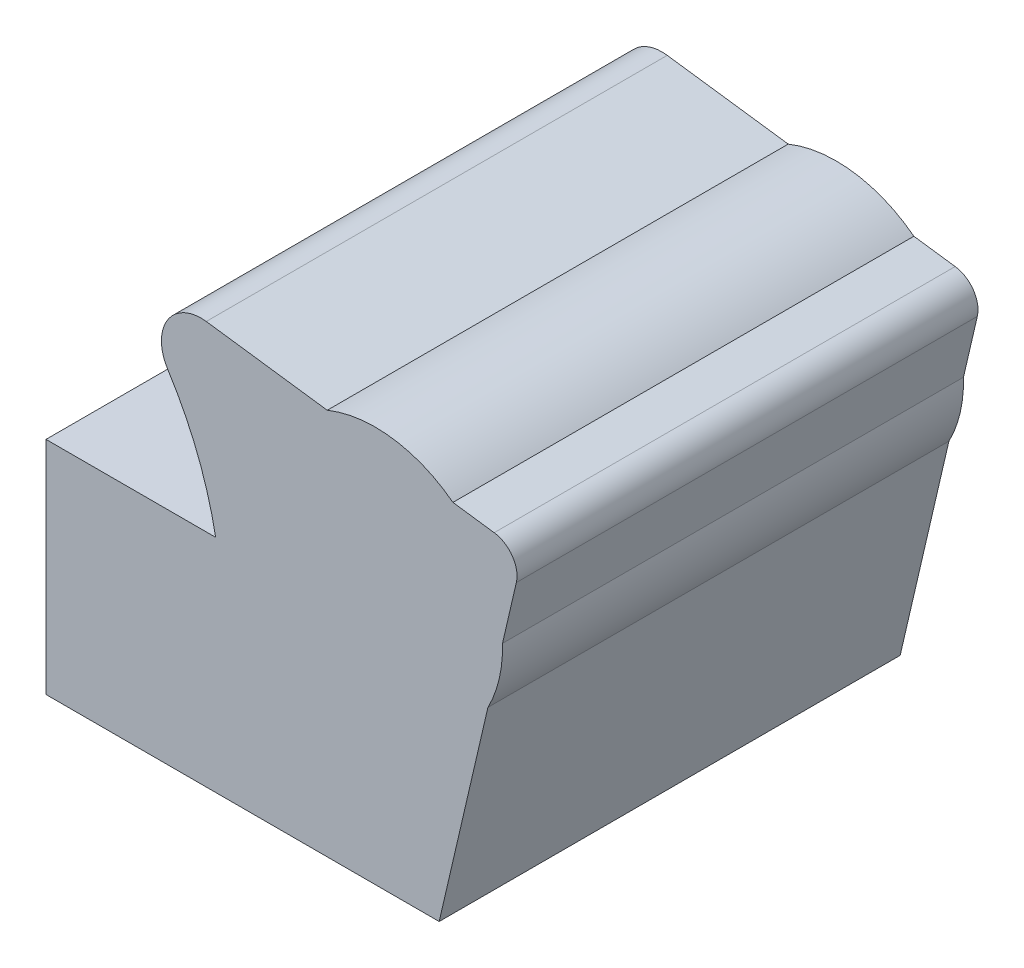
ISO-10303-21;
HEADER;
FILE_DESCRIPTION(('STEP AP214'),'2;1');
FILE_NAME('part.step','',(''),(''),'','','');
FILE_SCHEMA(('AUTOMOTIVE_DESIGN { 1 0 10303 214 1 1 1 1 }'));
ENDSEC;
DATA;
#1=APPLICATION_CONTEXT('core data for automotive mechanical design processes');
#2=APPLICATION_PROTOCOL_DEFINITION('international standard','automotive_design',2000,#1);
#3=PRODUCT_CONTEXT('',#1,'mechanical');
#4=PRODUCT('Part','Part','',(#3));
#5=PRODUCT_RELATED_PRODUCT_CATEGORY('part','',(#4));
#6=PRODUCT_DEFINITION_FORMATION('','',#4);
#7=PRODUCT_DEFINITION_CONTEXT('part definition',#1,'design');
#8=PRODUCT_DEFINITION('design','',#6,#7);
#9=PRODUCT_DEFINITION_SHAPE('','',#8);
#10=(LENGTH_UNIT() NAMED_UNIT(*) SI_UNIT(.MILLI.,.METRE.));
#11=(NAMED_UNIT(*) PLANE_ANGLE_UNIT() SI_UNIT($,.RADIAN.));
#12=(NAMED_UNIT(*) SI_UNIT($,.STERADIAN.) SOLID_ANGLE_UNIT());
#13=UNCERTAINTY_MEASURE_WITH_UNIT(LENGTH_MEASURE(1.E-05),#10,'distance_accuracy_value','');
#14=(GEOMETRIC_REPRESENTATION_CONTEXT(3) GLOBAL_UNCERTAINTY_ASSIGNED_CONTEXT((#13)) GLOBAL_UNIT_ASSIGNED_CONTEXT((#10,
#11,#12)) REPRESENTATION_CONTEXT('',''));
#15=CARTESIAN_POINT('',(0.,0.,0.));
#16=DIRECTION('',(0.,0.,1.));
#17=DIRECTION('',(1.,0.,0.));
#18=AXIS2_PLACEMENT_3D('',#15,#16,#17);
#19=CARTESIAN_POINT('',(19.0917847936775,82.3258456075658,50.));
#20=DIRECTION('',(0.,0.,-1.));
#21=DIRECTION('',(-1.,0.,0.));
#22=AXIS2_PLACEMENT_3D('',#19,#20,#21);
#23=CYLINDRICAL_SURFACE('',#22,74.3600000001127);
#24=CARTESIAN_POINT('',(19.0917847936775,82.3258456075658,-50.));
#25=DIRECTION('',(0.,0.,1.));
#26=DIRECTION('',(1.,0.,0.));
#27=AXIS2_PLACEMENT_3D('',#24,#25,#26);
#28=CIRCLE('',#27,74.3600000001127);
#29=CARTESIAN_POINT('',(81.786119565483,122.311217777117,-50.));
#30=VERTEX_POINT('',#29);
#31=CARTESIAN_POINT('',(92.2028645129567,95.8971249244899,-50.));
#32=VERTEX_POINT('',#31);
#33=EDGE_CURVE('E183',#30,#32,#28,.F.);
#34=ORIENTED_EDGE('',*,*,#33,.T.);
#35=DIRECTION('',(0.,0.,-1.));
#36=VECTOR('',#35,1.);
#37=CARTESIAN_POINT('',(92.2028645129567,95.8971249244899,50.));
#38=LINE('',#37,#36);
#39=CARTESIAN_POINT('',(92.2028645129567,95.8971249244899,50.));
#40=VERTEX_POINT('',#39);
#41=EDGE_CURVE('E198',#40,#32,#38,.T.);
#42=ORIENTED_EDGE('',*,*,#41,.F.);
#43=CARTESIAN_POINT('',(19.0917847936775,82.3258456075658,50.));
#44=DIRECTION('',(0.,0.,1.));
#45=DIRECTION('',(1.,0.,0.));
#46=AXIS2_PLACEMENT_3D('',#43,#44,#45);
#47=CIRCLE('',#46,74.3600000001127);
#48=CARTESIAN_POINT('',(81.786119565483,122.311217777117,50.));
#49=VERTEX_POINT('',#48);
#50=EDGE_CURVE('E228',#49,#40,#47,.F.);
#51=ORIENTED_EDGE('',*,*,#50,.F.);
#52=DIRECTION('',(0.,0.,-1.));
#53=VECTOR('',#52,1.);
#54=CARTESIAN_POINT('',(81.786119565483,122.311217777117,50.));
#55=LINE('',#54,#53);
#56=EDGE_CURVE('E200',#49,#30,#55,.T.);
#57=ORIENTED_EDGE('',*,*,#56,.T.);
#58=EDGE_LOOP('',(#34,#42,#51,#57));
#59=FACE_BOUND('',#58,.T.);
#60=ADVANCED_FACE('F36',(#59),#23,.F.);
#61=CARTESIAN_POINT('',(89.0200812699105,126.924914565904,50.));
#62=DIRECTION('',(0.,0.,-1.));
#63=DIRECTION('',(-1.,0.,0.));
#64=AXIS2_PLACEMENT_3D('',#61,#62,#63);
#65=CYLINDRICAL_SURFACE('',#64,8.57999999999931);
#66=CARTESIAN_POINT('',(89.0200812699105,126.924914565904,-50.));
#67=DIRECTION('',(0.,0.,1.));
#68=DIRECTION('',(1.,0.,0.));
#69=AXIS2_PLACEMENT_3D('',#66,#67,#68);
#70=CIRCLE('',#69,8.57999999999931);
#71=CARTESIAN_POINT('',(90.1698066016005,135.427533671901,-50.));
#72=VERTEX_POINT('',#71);
#73=EDGE_CURVE('E181',#72,#30,#70,.T.);
#74=ORIENTED_EDGE('',*,*,#73,.T.);
#75=ORIENTED_EDGE('',*,*,#56,.F.);
#76=CARTESIAN_POINT('',(89.0200812699105,126.924914565904,50.));
#77=DIRECTION('',(0.,0.,1.));
#78=DIRECTION('',(1.,0.,0.));
#79=AXIS2_PLACEMENT_3D('',#76,#77,#78);
#80=CIRCLE('',#79,8.57999999999931);
#81=CARTESIAN_POINT('',(90.1698066016005,135.427533671901,50.));
#82=VERTEX_POINT('',#81);
#83=EDGE_CURVE('E226',#82,#49,#80,.T.);
#84=ORIENTED_EDGE('',*,*,#83,.F.);
#85=DIRECTION('',(0.,0.,-1.));
#86=VECTOR('',#85,1.);
#87=CARTESIAN_POINT('',(90.1698066016005,135.427533671901,50.));
#88=LINE('',#87,#86);
#89=EDGE_CURVE('E203',#82,#72,#88,.T.);
#90=ORIENTED_EDGE('',*,*,#89,.T.);
#91=EDGE_LOOP('',(#74,#75,#84,#90));
#92=FACE_BOUND('',#91,.T.);
#93=ADVANCED_FACE('F224',(#92),#65,.T.);
#94=CARTESIAN_POINT('',(19.6028110655159,144.969612569904,50.));
#95=DIRECTION('',(-0.134000621409096,-0.990981247785232,0.));
#96=DIRECTION('',(0.990981247785232,-0.134000621409096,0.));
#97=AXIS2_PLACEMENT_3D('',#94,#95,#96);
#98=PLANE('',#97);
#99=DIRECTION('',(-0.990981247785232,0.134000621409096,0.));
#100=VECTOR('',#99,1.);
#101=CARTESIAN_POINT('',(19.6028110655159,144.969612569904,-50.));
#102=LINE('',#101,#100);
#103=CARTESIAN_POINT('',(116.418600533637,131.878168125385,-50.));
#104=VERTEX_POINT('',#103);
#105=EDGE_CURVE('E179',#104,#72,#102,.T.);
#106=ORIENTED_EDGE('',*,*,#105,.T.);
#107=ORIENTED_EDGE('',*,*,#89,.F.);
#108=DIRECTION('',(-0.990981247785232,0.134000621409096,0.));
#109=VECTOR('',#108,1.);
#110=CARTESIAN_POINT('',(19.6028110655159,144.969612569904,50.));
#111=LINE('',#110,#109);
#112=CARTESIAN_POINT('',(116.418600533637,131.878168125385,50.));
#113=VERTEX_POINT('',#112);
#114=EDGE_CURVE('E229',#113,#82,#111,.T.);
#115=ORIENTED_EDGE('',*,*,#114,.F.);
#116=DIRECTION('',(0.,0.,-1.));
#117=VECTOR('',#116,1.);
#118=CARTESIAN_POINT('',(116.418600533637,131.878168125385,50.));
#119=LINE('',#118,#117);
#120=EDGE_CURVE('E206',#113,#104,#119,.T.);
#121=ORIENTED_EDGE('',*,*,#120,.T.);
#122=EDGE_LOOP('',(#106,#107,#115,#121));
#123=FACE_BOUND('',#122,.T.);
#124=ADVANCED_FACE('F220',(#123),#98,.F.);
#125=CARTESIAN_POINT('',(126.840999999996,106.3205,50.));
#126=DIRECTION('',(0.,0.,-1.));
#127=DIRECTION('',(-1.,0.,0.));
#128=AXIS2_PLACEMENT_3D('',#125,#126,#127);
#129=CYLINDRICAL_SURFACE('',#128,27.6011016201112);
#130=CARTESIAN_POINT('',(126.840999999996,106.3205,-50.));
#131=DIRECTION('',(0.,0.,1.));
#132=DIRECTION('',(1.,0.,0.));
#133=AXIS2_PLACEMENT_3D('',#130,#131,#132);
#134=CIRCLE('',#133,27.6011016201112);
#135=CARTESIAN_POINT('',(143.676819781968,128.192307947965,-50.));
#136=VERTEX_POINT('',#135);
#137=EDGE_CURVE('E176',#136,#104,#134,.T.);
#138=ORIENTED_EDGE('',*,*,#137,.T.);
#139=ORIENTED_EDGE('',*,*,#120,.F.);
#140=CARTESIAN_POINT('',(126.840999999996,106.3205,50.));
#141=DIRECTION('',(0.,0.,1.));
#142=DIRECTION('',(1.,0.,0.));
#143=AXIS2_PLACEMENT_3D('',#140,#141,#142);
#144=CIRCLE('',#143,27.6011016201112);
#145=CARTESIAN_POINT('',(143.676819781968,128.192307947965,50.));
#146=VERTEX_POINT('',#145);
#147=EDGE_CURVE('E213',#146,#113,#144,.T.);
#148=ORIENTED_EDGE('',*,*,#147,.F.);
#149=DIRECTION('',(0.,0.,-1.));
#150=VECTOR('',#149,1.);
#151=CARTESIAN_POINT('',(143.676819781968,128.192307947965,50.));
#152=LINE('',#151,#150);
#153=EDGE_CURVE('E154',#146,#136,#152,.T.);
#154=ORIENTED_EDGE('',*,*,#153,.T.);
#155=EDGE_LOOP('',(#138,#139,#148,#154));
#156=FACE_BOUND('',#155,.T.);
#157=ADVANCED_FACE('F209',(#156),#129,.T.);
#158=CARTESIAN_POINT('',(19.6028110655159,144.969612569904,50.));
#159=DIRECTION('',(-0.134000621409096,-0.990981247785232,0.));
#160=DIRECTION('',(0.990981247785232,-0.134000621409096,0.));
#161=AXIS2_PLACEMENT_3D('',#158,#159,#160);
#162=PLANE('',#161);
#163=DIRECTION('',(-0.990981247785232,0.134000621409096,0.));
#164=VECTOR('',#163,1.);
#165=CARTESIAN_POINT('',(19.6028110655159,144.969612569904,-50.));
#166=LINE('',#165,#164);
#167=CARTESIAN_POINT('',(152.63248355446,126.981321853801,-50.));
#168=VERTEX_POINT('',#167);
#169=EDGE_CURVE('E173',#168,#136,#166,.T.);
#170=ORIENTED_EDGE('',*,*,#169,.T.);
#171=ORIENTED_EDGE('',*,*,#153,.F.);
#172=DIRECTION('',(-0.990981247785232,0.134000621409096,0.));
#173=VECTOR('',#172,1.);
#174=CARTESIAN_POINT('',(19.6028110655159,144.969612569904,50.));
#175=LINE('',#174,#173);
#176=CARTESIAN_POINT('',(152.63248355446,126.981321853801,50.));
#177=VERTEX_POINT('',#176);
#178=EDGE_CURVE('E145',#177,#146,#175,.T.);
#179=ORIENTED_EDGE('',*,*,#178,.F.);
#180=DIRECTION('',(0.,0.,-1.));
#181=VECTOR('',#180,1.);
#182=CARTESIAN_POINT('',(152.63248355446,126.981321853801,50.));
#183=LINE('',#182,#181);
#184=EDGE_CURVE('E143',#177,#168,#183,.T.);
#185=ORIENTED_EDGE('',*,*,#184,.T.);
#186=EDGE_LOOP('',(#170,#171,#179,#185));
#187=FACE_BOUND('',#186,.T.);
#188=ADVANCED_FACE('F215',(#187),#162,.F.);
#189=CARTESIAN_POINT('',(151.866,121.31290911647,50.));
#190=DIRECTION('',(0.,0.,-1.));
#191=DIRECTION('',(-1.,0.,0.));
#192=AXIS2_PLACEMENT_3D('',#189,#190,#191);
#193=CYLINDRICAL_SURFACE('',#192,5.71999999999941);
#194=CARTESIAN_POINT('',(151.866,121.31290911647,-50.));
#195=DIRECTION('',(0.,0.,1.));
#196=DIRECTION('',(1.,0.,0.));
#197=AXIS2_PLACEMENT_3D('',#194,#195,#196);
#198=CIRCLE('',#197,5.71999999999941);
#199=CARTESIAN_POINT('',(157.437634446656,120.01857933128,-50.));
#200=VERTEX_POINT('',#199);
#201=EDGE_CURVE('E166',#200,#168,#198,.T.);
#202=ORIENTED_EDGE('',*,*,#201,.T.);
#203=ORIENTED_EDGE('',*,*,#184,.F.);
#204=CARTESIAN_POINT('',(151.866,121.31290911647,50.));
#205=DIRECTION('',(0.,0.,1.));
#206=DIRECTION('',(1.,0.,0.));
#207=AXIS2_PLACEMENT_3D('',#204,#205,#206);
#208=CIRCLE('',#207,5.71999999999941);
#209=CARTESIAN_POINT('',(157.437634446656,120.01857933128,50.));
#210=VERTEX_POINT('',#209);
#211=EDGE_CURVE('E129',#210,#177,#208,.T.);
#212=ORIENTED_EDGE('',*,*,#211,.F.);
#213=DIRECTION('',(0.,0.,-1.));
#214=VECTOR('',#213,1.);
#215=CARTESIAN_POINT('',(157.437634446656,120.01857933128,50.));
#216=LINE('',#215,#214);
#217=EDGE_CURVE('E141',#210,#200,#216,.T.);
#218=ORIENTED_EDGE('',*,*,#217,.T.);
#219=EDGE_LOOP('',(#202,#203,#212,#218));
#220=FACE_BOUND('',#219,.T.);
#221=ADVANCED_FACE('F140',(#220),#193,.T.);
#222=CARTESIAN_POINT('',(122.922758843375,-28.5558195843682,50.));
#223=DIRECTION('',(-0.974061966198679,0.226281430977365,0.));
#224=DIRECTION('',(-0.226281430977365,-0.974061966198679,0.));
#225=AXIS2_PLACEMENT_3D('',#222,#223,#224);
#226=PLANE('',#225);
#227=DIRECTION('',(0.,0.,-1.));
#228=VECTOR('',#227,1.);
#229=CARTESIAN_POINT('',(154.431677752707,107.078993104652,50.));
#230=LINE('',#229,#228);
#231=CARTESIAN_POINT('',(154.431677752707,107.078993104652,-50.));
#232=VERTEX_POINT('',#231);
#233=CARTESIAN_POINT('',(154.431677752707,107.078993104652,50.));
#234=VERTEX_POINT('',#233);
#235=EDGE_CURVE('E44',#232,#234,#230,.F.);
#236=ORIENTED_EDGE('',*,*,#235,.F.);
#237=DIRECTION('',(0.226281430977365,0.974061966198679,0.));
#238=VECTOR('',#237,1.);
#239=CARTESIAN_POINT('',(122.922758843375,-28.5558195843682,-50.));
#240=LINE('',#239,#238);
#241=EDGE_CURVE('E149',#232,#200,#240,.T.);
#242=ORIENTED_EDGE('',*,*,#241,.T.);
#243=ORIENTED_EDGE('',*,*,#217,.F.);
#244=DIRECTION('',(0.226281430977365,0.974061966198679,0.));
#245=VECTOR('',#244,1.);
#246=CARTESIAN_POINT('',(122.922758843375,-28.5558195843682,50.));
#247=LINE('',#246,#245);
#248=EDGE_CURVE('E124',#234,#210,#247,.T.);
#249=ORIENTED_EDGE('',*,*,#248,.F.);
#250=EDGE_LOOP('',(#236,#242,#243,#249));
#251=FACE_BOUND('',#250,.T.);
#252=ADVANCED_FACE('F147',(#251),#226,.F.);
#253=CARTESIAN_POINT('',(126.840999999996,106.3205,50.));
#254=DIRECTION('',(0.,0.,-1.));
#255=DIRECTION('',(-1.,0.,0.));
#256=AXIS2_PLACEMENT_3D('',#253,#254,#255);
#257=CYLINDRICAL_SURFACE('',#256,27.6011016201112);
#258=CARTESIAN_POINT('',(126.840999999996,106.3205,-50.));
#259=DIRECTION('',(0.,0.,1.));
#260=DIRECTION('',(1.,0.,0.));
#261=AXIS2_PLACEMENT_3D('',#258,#259,#260);
#262=CIRCLE('',#261,27.6011016201112);
#263=CARTESIAN_POINT('',(151.271848854584,93.4770411633782,-50.));
#264=VERTEX_POINT('',#263);
#265=EDGE_CURVE('E159',#264,#232,#262,.T.);
#266=ORIENTED_EDGE('',*,*,#265,.T.);
#267=ORIENTED_EDGE('',*,*,#235,.T.);
#268=CARTESIAN_POINT('',(126.840999999996,106.3205,50.));
#269=DIRECTION('',(0.,0.,1.));
#270=DIRECTION('',(1.,0.,0.));
#271=AXIS2_PLACEMENT_3D('',#268,#269,#270);
#272=CIRCLE('',#271,27.6011016201112);
#273=CARTESIAN_POINT('',(151.271848854584,93.4770411633782,50.));
#274=VERTEX_POINT('',#273);
#275=EDGE_CURVE('E133',#274,#234,#272,.T.);
#276=ORIENTED_EDGE('',*,*,#275,.F.);
#277=DIRECTION('',(0.,0.,-1.));
#278=VECTOR('',#277,1.);
#279=CARTESIAN_POINT('',(151.271848854584,93.4770411633782,50.));
#280=LINE('',#279,#278);
#281=EDGE_CURVE('E151',#274,#264,#280,.T.);
#282=ORIENTED_EDGE('',*,*,#281,.T.);
#283=EDGE_LOOP('',(#266,#267,#276,#282));
#284=FACE_BOUND('',#283,.T.);
#285=ADVANCED_FACE('F38',(#284),#257,.T.);
#286=CARTESIAN_POINT('',(0.,95.8971249244899,50.));
#287=DIRECTION('',(0.,1.,0.));
#288=DIRECTION('',(0.,0.,1.));
#289=AXIS2_PLACEMENT_3D('',#286,#287,#288);
#290=PLANE('',#289);
#291=DIRECTION('',(1.,0.,0.));
#292=VECTOR('',#291,1.);
#293=CARTESIAN_POINT('',(0.,95.8971249244899,-50.));
#294=LINE('',#293,#292);
#295=CARTESIAN_POINT('',(55.4044049790674,95.8971249244899,-50.));
#296=VERTEX_POINT('',#295);
#297=EDGE_CURVE('E186',#296,#32,#294,.T.);
#298=ORIENTED_EDGE('',*,*,#297,.F.);
#299=DIRECTION('',(0.,0.,-1.));
#300=VECTOR('',#299,1.);
#301=CARTESIAN_POINT('',(55.4044049790674,95.8971249244899,50.));
#302=LINE('',#301,#300);
#303=CARTESIAN_POINT('',(55.4044049790674,95.8971249244899,50.));
#304=VERTEX_POINT('',#303);
#305=EDGE_CURVE('E195',#304,#296,#302,.T.);
#306=ORIENTED_EDGE('',*,*,#305,.F.);
#307=DIRECTION('',(1.,0.,0.));
#308=VECTOR('',#307,1.);
#309=CARTESIAN_POINT('',(0.,95.8971249244899,50.));
#310=LINE('',#309,#308);
#311=EDGE_CURVE('E231',#304,#40,#310,.T.);
#312=ORIENTED_EDGE('',*,*,#311,.T.);
#313=ORIENTED_EDGE('',*,*,#41,.T.);
#314=EDGE_LOOP('',(#298,#306,#312,#313));
#315=FACE_BOUND('',#314,.T.);
#316=ADVANCED_FACE('F252',(#315),#290,.T.);
#317=CARTESIAN_POINT('',(0.,0.,50.));
#318=DIRECTION('',(0.,0.,1.));
#319=DIRECTION('',(1.,0.,0.));
#320=AXIS2_PLACEMENT_3D('',#317,#318,#319);
#321=PLANE('',#320);
#322=DIRECTION('',(0.,1.,0.));
#323=VECTOR('',#322,1.);
#324=CARTESIAN_POINT('',(55.4044049790674,0.,50.));
#325=LINE('',#324,#323);
#326=CARTESIAN_POINT('',(55.4044049790674,47.9623912919101,50.));
#327=VERTEX_POINT('',#326);
#328=EDGE_CURVE('E237',#327,#304,#325,.T.);
#329=ORIENTED_EDGE('',*,*,#328,.F.);
#330=DIRECTION('',(1.,0.,0.));
#331=VECTOR('',#330,1.);
#332=CARTESIAN_POINT('',(0.,47.9623912919101,50.));
#333=LINE('',#332,#331);
#334=CARTESIAN_POINT('',(140.698476255362,47.9623912919101,50.));
#335=VERTEX_POINT('',#334);
#336=EDGE_CURVE('E57',#327,#335,#333,.T.);
#337=ORIENTED_EDGE('',*,*,#336,.T.);
#338=EDGE_CURVE('E136',#335,#274,#247,.T.);
#339=ORIENTED_EDGE('',*,*,#338,.T.);
#340=ORIENTED_EDGE('',*,*,#275,.T.);
#341=ORIENTED_EDGE('',*,*,#248,.T.);
#342=ORIENTED_EDGE('',*,*,#211,.T.);
#343=ORIENTED_EDGE('',*,*,#178,.T.);
#344=ORIENTED_EDGE('',*,*,#147,.T.);
#345=ORIENTED_EDGE('',*,*,#114,.T.);
#346=ORIENTED_EDGE('',*,*,#83,.T.);
#347=ORIENTED_EDGE('',*,*,#50,.T.);
#348=ORIENTED_EDGE('',*,*,#311,.F.);
#349=EDGE_LOOP('',(#329,#337,#339,#340,#341,#342,#343,#344,#345,#346,#347,#348));
#350=FACE_BOUND('',#349,.T.);
#351=ADVANCED_FACE('F127',(#350),#321,.T.);
#352=ORIENTED_EDGE('',*,*,#281,.F.);
#353=ORIENTED_EDGE('',*,*,#338,.F.);
#354=DIRECTION('',(0.,0.,-1.));
#355=VECTOR('',#354,1.);
#356=CARTESIAN_POINT('',(140.698476255362,47.9623912919101,50.));
#357=LINE('',#356,#355);
#358=CARTESIAN_POINT('',(140.698476255362,47.9623912919101,-50.));
#359=VERTEX_POINT('',#358);
#360=EDGE_CURVE('E192',#335,#359,#357,.T.);
#361=ORIENTED_EDGE('',*,*,#360,.T.);
#362=EDGE_CURVE('E167',#359,#264,#240,.T.);
#363=ORIENTED_EDGE('',*,*,#362,.T.);
#364=EDGE_LOOP('',(#352,#353,#361,#363));
#365=FACE_BOUND('',#364,.T.);
#366=ADVANCED_FACE('F244',(#365),#226,.F.);
#367=CARTESIAN_POINT('',(0.,0.,-50.));
#368=DIRECTION('',(0.,0.,1.));
#369=DIRECTION('',(1.,0.,0.));
#370=AXIS2_PLACEMENT_3D('',#367,#368,#369);
#371=PLANE('',#370);
#372=DIRECTION('',(1.,0.,0.));
#373=VECTOR('',#372,1.);
#374=CARTESIAN_POINT('',(0.,47.9623912919101,-50.));
#375=LINE('',#374,#373);
#376=CARTESIAN_POINT('',(55.4044049790674,47.9623912919101,-50.));
#377=VERTEX_POINT('',#376);
#378=EDGE_CURVE('E51',#377,#359,#375,.T.);
#379=ORIENTED_EDGE('',*,*,#378,.F.);
#380=DIRECTION('',(0.,1.,0.));
#381=VECTOR('',#380,1.);
#382=CARTESIAN_POINT('',(55.4044049790674,0.,-50.));
#383=LINE('',#382,#381);
#384=EDGE_CURVE('E189',#377,#296,#383,.T.);
#385=ORIENTED_EDGE('',*,*,#384,.T.);
#386=ORIENTED_EDGE('',*,*,#297,.T.);
#387=ORIENTED_EDGE('',*,*,#33,.F.);
#388=ORIENTED_EDGE('',*,*,#73,.F.);
#389=ORIENTED_EDGE('',*,*,#105,.F.);
#390=ORIENTED_EDGE('',*,*,#137,.F.);
#391=ORIENTED_EDGE('',*,*,#169,.F.);
#392=ORIENTED_EDGE('',*,*,#201,.F.);
#393=ORIENTED_EDGE('',*,*,#241,.F.);
#394=ORIENTED_EDGE('',*,*,#265,.F.);
#395=ORIENTED_EDGE('',*,*,#362,.F.);
#396=EDGE_LOOP('',(#379,#385,#386,#387,#388,#389,#390,#391,#392,#393,#394,#395));
#397=FACE_BOUND('',#396,.T.);
#398=ADVANCED_FACE('F164',(#397),#371,.F.);
#399=CARTESIAN_POINT('',(0.,47.9623912919101,50.));
#400=DIRECTION('',(0.,1.,0.));
#401=DIRECTION('',(0.,0.,1.));
#402=AXIS2_PLACEMENT_3D('',#399,#400,#401);
#403=PLANE('',#402);
#404=ORIENTED_EDGE('',*,*,#378,.T.);
#405=ORIENTED_EDGE('',*,*,#360,.F.);
#406=ORIENTED_EDGE('',*,*,#336,.F.);
#407=DIRECTION('',(0.,0.,-1.));
#408=VECTOR('',#407,1.);
#409=CARTESIAN_POINT('',(55.4044049790674,47.9623912919101,50.));
#410=LINE('',#409,#408);
#411=EDGE_CURVE('E11',#327,#377,#410,.T.);
#412=ORIENTED_EDGE('',*,*,#411,.T.);
#413=EDGE_LOOP('',(#404,#405,#406,#412));
#414=FACE_BOUND('',#413,.T.);
#415=ADVANCED_FACE('F242',(#414),#403,.F.);
#416=CARTESIAN_POINT('',(55.4044049790674,0.,50.));
#417=DIRECTION('',(-1.,0.,0.));
#418=DIRECTION('',(0.,-1.,0.));
#419=AXIS2_PLACEMENT_3D('',#416,#417,#418);
#420=PLANE('',#419);
#421=ORIENTED_EDGE('',*,*,#411,.F.);
#422=ORIENTED_EDGE('',*,*,#328,.T.);
#423=ORIENTED_EDGE('',*,*,#305,.T.);
#424=ORIENTED_EDGE('',*,*,#384,.F.);
#425=EDGE_LOOP('',(#421,#422,#423,#424));
#426=FACE_BOUND('',#425,.T.);
#427=ADVANCED_FACE('F256',(#426),#420,.T.);
#428=CLOSED_SHELL('',(#60,#93,#124,#157,#188,#221,#252,#285,#316,#351,#366,#398,#415,#427));
#429=MANIFOLD_SOLID_BREP('B2',#428);
#430=ADVANCED_BREP_SHAPE_REPRESENTATION('',(#18,#429),#14);
#431=SHAPE_DEFINITION_REPRESENTATION(#9,#430);
ENDSEC;
END-ISO-10303-21;
